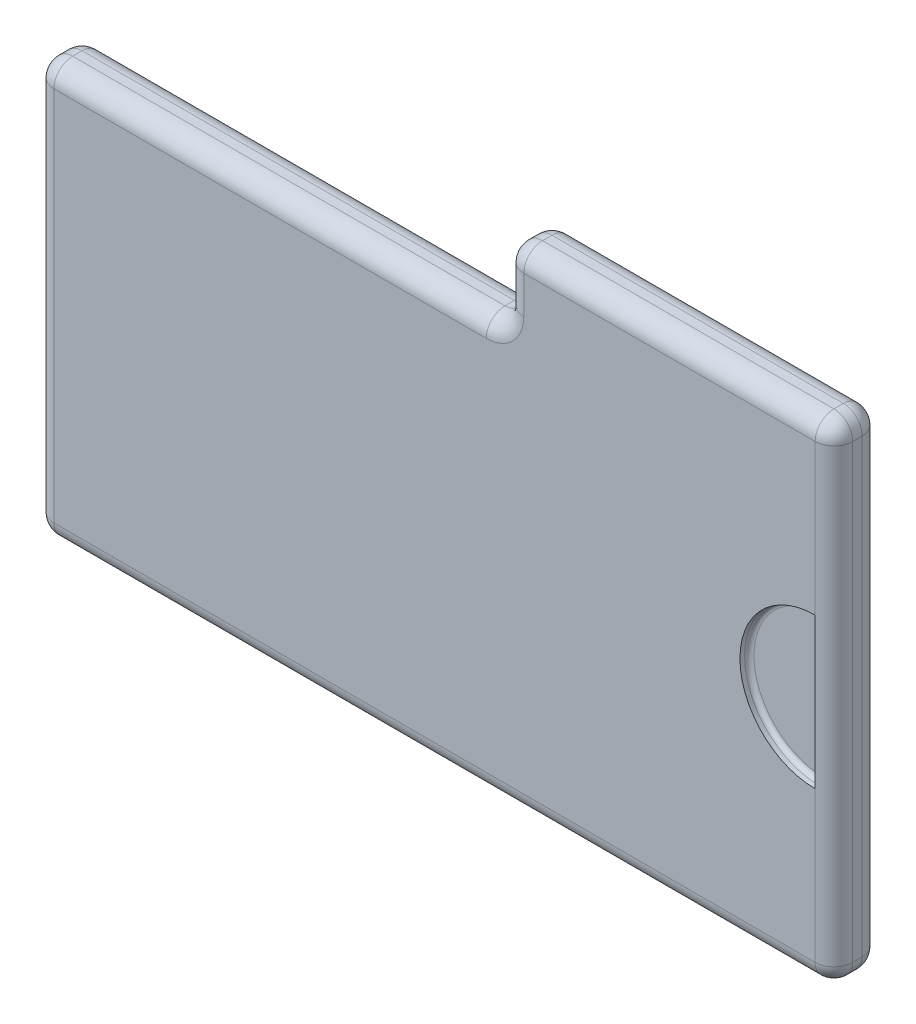
ISO-10303-21;
HEADER;
FILE_DESCRIPTION(('STEP AP214'),'2;1');
FILE_NAME('part.step','',(''),(''),'','','');
FILE_SCHEMA(('AUTOMOTIVE_DESIGN { 1 0 10303 214 1 1 1 1 }'));
ENDSEC;
DATA;
#1=APPLICATION_CONTEXT('core data for automotive mechanical design processes');
#2=APPLICATION_PROTOCOL_DEFINITION('international standard','automotive_design',2000,#1);
#3=PRODUCT_CONTEXT('',#1,'mechanical');
#4=PRODUCT('Part','Part','',(#3));
#5=PRODUCT_RELATED_PRODUCT_CATEGORY('part','',(#4));
#6=PRODUCT_DEFINITION_FORMATION('','',#4);
#7=PRODUCT_DEFINITION_CONTEXT('part definition',#1,'design');
#8=PRODUCT_DEFINITION('design','',#6,#7);
#9=PRODUCT_DEFINITION_SHAPE('','',#8);
#10=(LENGTH_UNIT() NAMED_UNIT(*) SI_UNIT(.MILLI.,.METRE.));
#11=(NAMED_UNIT(*) PLANE_ANGLE_UNIT() SI_UNIT($,.RADIAN.));
#12=(NAMED_UNIT(*) SI_UNIT($,.STERADIAN.) SOLID_ANGLE_UNIT());
#13=UNCERTAINTY_MEASURE_WITH_UNIT(LENGTH_MEASURE(1.E-05),#10,'distance_accuracy_value','');
#14=(GEOMETRIC_REPRESENTATION_CONTEXT(3) GLOBAL_UNCERTAINTY_ASSIGNED_CONTEXT((#13)) GLOBAL_UNIT_ASSIGNED_CONTEXT((#10,
#11,#12)) REPRESENTATION_CONTEXT('',''));
#15=CARTESIAN_POINT('',(0.,0.,0.));
#16=DIRECTION('',(0.,0.,1.));
#17=DIRECTION('',(1.,0.,0.));
#18=AXIS2_PLACEMENT_3D('',#15,#16,#17);
#19=CARTESIAN_POINT('',(42.5,26.,2.5));
#20=DIRECTION('',(-1.,0.,0.));
#21=DIRECTION('',(0.,0.,1.));
#22=AXIS2_PLACEMENT_3D('',#19,#20,#21);
#23=PLANE('',#22);
#24=DIRECTION('',(0.,1.,0.));
#25=VECTOR('',#24,1.);
#26=CARTESIAN_POINT('',(42.5,26.,-0.5));
#27=LINE('',#26,#25);
#28=CARTESIAN_POINT('',(42.5,-24.,-0.5));
#29=VERTEX_POINT('',#28);
#30=CARTESIAN_POINT('',(42.5,24.,-0.5));
#31=VERTEX_POINT('',#30);
#32=EDGE_CURVE('E292',#29,#31,#27,.T.);
#33=ORIENTED_EDGE('',*,*,#32,.T.);
#34=DIRECTION('',(0.,0.,-1.));
#35=VECTOR('',#34,1.);
#36=CARTESIAN_POINT('',(42.5,24.,2.5));
#37=LINE('',#36,#35);
#38=CARTESIAN_POINT('',(42.5,24.,0.5));
#39=VERTEX_POINT('',#38);
#40=EDGE_CURVE('E299',#31,#39,#37,.F.);
#41=ORIENTED_EDGE('',*,*,#40,.T.);
#42=DIRECTION('',(0.,1.,0.));
#43=VECTOR('',#42,1.);
#44=CARTESIAN_POINT('',(42.5,-26.,0.5));
#45=LINE('',#44,#43);
#46=CARTESIAN_POINT('',(42.5,-24.,0.5));
#47=VERTEX_POINT('',#46);
#48=EDGE_CURVE('E295',#39,#47,#45,.F.);
#49=ORIENTED_EDGE('',*,*,#48,.T.);
#50=DIRECTION('',(0.,0.,-1.));
#51=VECTOR('',#50,1.);
#52=CARTESIAN_POINT('',(42.5,-24.,2.5));
#53=LINE('',#52,#51);
#54=EDGE_CURVE('E289',#47,#29,#53,.T.);
#55=ORIENTED_EDGE('',*,*,#54,.T.);
#56=EDGE_LOOP('',(#33,#41,#49,#55));
#57=FACE_BOUND('',#56,.T.);
#58=ADVANCED_FACE('F47',(#57),#23,.F.);
#59=CARTESIAN_POINT('',(7.5,26.,2.5));
#60=DIRECTION('',(0.,-1.,0.));
#61=DIRECTION('',(0.,0.,-1.));
#62=AXIS2_PLACEMENT_3D('',#59,#60,#61);
#63=PLANE('',#62);
#64=DIRECTION('',(-1.,0.,0.));
#65=VECTOR('',#64,1.);
#66=CARTESIAN_POINT('',(42.5,26.,0.5));
#67=LINE('',#66,#65);
#68=CARTESIAN_POINT('',(9.49999999999999,26.,0.5));
#69=VERTEX_POINT('',#68);
#70=CARTESIAN_POINT('',(40.5,26.,0.5));
#71=VERTEX_POINT('',#70);
#72=EDGE_CURVE('E308',#69,#71,#67,.F.);
#73=ORIENTED_EDGE('',*,*,#72,.T.);
#74=DIRECTION('',(0.,0.,-1.));
#75=VECTOR('',#74,1.);
#76=CARTESIAN_POINT('',(40.5,26.,2.5));
#77=LINE('',#76,#75);
#78=CARTESIAN_POINT('',(40.5,26.,-0.5));
#79=VERTEX_POINT('',#78);
#80=EDGE_CURVE('E311',#71,#79,#77,.T.);
#81=ORIENTED_EDGE('',*,*,#80,.T.);
#82=DIRECTION('',(-1.,0.,0.));
#83=VECTOR('',#82,1.);
#84=CARTESIAN_POINT('',(7.5,26.,-0.5));
#85=LINE('',#84,#83);
#86=CARTESIAN_POINT('',(9.49999999999999,26.,-0.5));
#87=VERTEX_POINT('',#86);
#88=EDGE_CURVE('E302',#79,#87,#85,.T.);
#89=ORIENTED_EDGE('',*,*,#88,.T.);
#90=DIRECTION('',(0.,0.,-1.));
#91=VECTOR('',#90,1.);
#92=CARTESIAN_POINT('',(9.49999999999999,26.,2.5));
#93=LINE('',#92,#91);
#94=EDGE_CURVE('E305',#87,#69,#93,.F.);
#95=ORIENTED_EDGE('',*,*,#94,.T.);
#96=EDGE_LOOP('',(#73,#81,#89,#95));
#97=FACE_BOUND('',#96,.T.);
#98=ADVANCED_FACE('F631',(#97),#63,.F.);
#99=CARTESIAN_POINT('',(7.5,26.,2.5));
#100=DIRECTION('',(1.,0.,0.));
#101=DIRECTION('',(0.,1.,0.));
#102=AXIS2_PLACEMENT_3D('',#99,#100,#101);
#103=PLANE('',#102);
#104=DIRECTION('',(0.,-1.,0.));
#105=VECTOR('',#104,1.);
#106=CARTESIAN_POINT('',(7.5,26.,0.5));
#107=LINE('',#106,#105);
#108=CARTESIAN_POINT('',(7.5,20.,0.5));
#109=VERTEX_POINT('',#108);
#110=CARTESIAN_POINT('',(7.5,24.,0.5));
#111=VERTEX_POINT('',#110);
#112=EDGE_CURVE('E259',#109,#111,#107,.F.);
#113=ORIENTED_EDGE('',*,*,#112,.T.);
#114=DIRECTION('',(0.,0.,-1.));
#115=VECTOR('',#114,1.);
#116=CARTESIAN_POINT('',(7.5,24.,2.5));
#117=LINE('',#116,#115);
#118=CARTESIAN_POINT('',(7.5,24.,-0.5));
#119=VERTEX_POINT('',#118);
#120=EDGE_CURVE('E263',#111,#119,#117,.T.);
#121=ORIENTED_EDGE('',*,*,#120,.T.);
#122=DIRECTION('',(0.,-1.,0.));
#123=VECTOR('',#122,1.);
#124=CARTESIAN_POINT('',(7.5,26.,-0.5));
#125=LINE('',#124,#123);
#126=CARTESIAN_POINT('',(7.5,20.,-0.5));
#127=VERTEX_POINT('',#126);
#128=EDGE_CURVE('E256',#119,#127,#125,.T.);
#129=ORIENTED_EDGE('',*,*,#128,.T.);
#130=DIRECTION('',(0.,0.,-1.));
#131=VECTOR('',#130,1.);
#132=CARTESIAN_POINT('',(7.5,20.,2.5));
#133=LINE('',#132,#131);
#134=EDGE_CURVE('E253',#127,#109,#133,.F.);
#135=ORIENTED_EDGE('',*,*,#134,.T.);
#136=EDGE_LOOP('',(#113,#121,#129,#135));
#137=FACE_BOUND('',#136,.T.);
#138=ADVANCED_FACE('F635',(#137),#103,.F.);
#139=CARTESIAN_POINT('',(-7.5,18.,2.5));
#140=DIRECTION('',(0.,-1.,0.));
#141=DIRECTION('',(1.,0.,0.));
#142=AXIS2_PLACEMENT_3D('',#139,#140,#141);
#143=PLANE('',#142);
#144=DIRECTION('',(-1.,0.,0.));
#145=VECTOR('',#144,1.);
#146=CARTESIAN_POINT('',(7.5,18.,0.5));
#147=LINE('',#146,#145);
#148=CARTESIAN_POINT('',(-40.5,18.,0.5));
#149=VERTEX_POINT('',#148);
#150=CARTESIAN_POINT('',(5.5,18.,0.5));
#151=VERTEX_POINT('',#150);
#152=EDGE_CURVE('E321',#149,#151,#147,.F.);
#153=ORIENTED_EDGE('',*,*,#152,.T.);
#154=DIRECTION('',(0.,0.,-1.));
#155=VECTOR('',#154,1.);
#156=CARTESIAN_POINT('',(5.5,18.,-2.5));
#157=LINE('',#156,#155);
#158=CARTESIAN_POINT('',(5.5,18.,-0.5));
#159=VERTEX_POINT('',#158);
#160=EDGE_CURVE('E324',#151,#159,#157,.T.);
#161=ORIENTED_EDGE('',*,*,#160,.T.);
#162=DIRECTION('',(-1.,0.,0.));
#163=VECTOR('',#162,1.);
#164=CARTESIAN_POINT('',(-7.5,18.,-0.5));
#165=LINE('',#164,#163);
#166=CARTESIAN_POINT('',(-40.5,18.,-0.5));
#167=VERTEX_POINT('',#166);
#168=EDGE_CURVE('E318',#159,#167,#165,.T.);
#169=ORIENTED_EDGE('',*,*,#168,.T.);
#170=DIRECTION('',(0.,0.,-1.));
#171=VECTOR('',#170,1.);
#172=CARTESIAN_POINT('',(-40.5,18.,2.5));
#173=LINE('',#172,#171);
#174=EDGE_CURVE('E315',#167,#149,#173,.F.);
#175=ORIENTED_EDGE('',*,*,#174,.T.);
#176=EDGE_LOOP('',(#153,#161,#169,#175));
#177=FACE_BOUND('',#176,.T.);
#178=ADVANCED_FACE('F639',(#177),#143,.F.);
#179=CARTESIAN_POINT('',(-42.5,18.,2.5));
#180=DIRECTION('',(1.,0.,0.));
#181=DIRECTION('',(0.,0.,-1.));
#182=AXIS2_PLACEMENT_3D('',#179,#180,#181);
#183=PLANE('',#182);
#184=DIRECTION('',(0.,-1.,0.));
#185=VECTOR('',#184,1.);
#186=CARTESIAN_POINT('',(-42.5,18.,0.5));
#187=LINE('',#186,#185);
#188=CARTESIAN_POINT('',(-42.5,-24.,0.5));
#189=VERTEX_POINT('',#188);
#190=CARTESIAN_POINT('',(-42.5,16.,0.5));
#191=VERTEX_POINT('',#190);
#192=EDGE_CURVE('E334',#189,#191,#187,.F.);
#193=ORIENTED_EDGE('',*,*,#192,.T.);
#194=DIRECTION('',(0.,0.,-1.));
#195=VECTOR('',#194,1.);
#196=CARTESIAN_POINT('',(-42.5,16.,2.5));
#197=LINE('',#196,#195);
#198=CARTESIAN_POINT('',(-42.5,16.,-0.5));
#199=VERTEX_POINT('',#198);
#200=EDGE_CURVE('E337',#191,#199,#197,.T.);
#201=ORIENTED_EDGE('',*,*,#200,.T.);
#202=DIRECTION('',(0.,-1.,0.));
#203=VECTOR('',#202,1.);
#204=CARTESIAN_POINT('',(-42.5,18.,-0.5));
#205=LINE('',#204,#203);
#206=CARTESIAN_POINT('',(-42.5,-24.,-0.5));
#207=VERTEX_POINT('',#206);
#208=EDGE_CURVE('E331',#199,#207,#205,.T.);
#209=ORIENTED_EDGE('',*,*,#208,.T.);
#210=DIRECTION('',(0.,0.,-1.));
#211=VECTOR('',#210,1.);
#212=CARTESIAN_POINT('',(-42.5,-24.,2.5));
#213=LINE('',#212,#211);
#214=EDGE_CURVE('E328',#207,#189,#213,.F.);
#215=ORIENTED_EDGE('',*,*,#214,.T.);
#216=EDGE_LOOP('',(#193,#201,#209,#215));
#217=FACE_BOUND('',#216,.T.);
#218=ADVANCED_FACE('F643',(#217),#183,.F.);
#219=CARTESIAN_POINT('',(-42.5,-26.,2.5));
#220=DIRECTION('',(0.,1.,0.));
#221=DIRECTION('',(-1.,0.,0.));
#222=AXIS2_PLACEMENT_3D('',#219,#220,#221);
#223=PLANE('',#222);
#224=DIRECTION('',(1.,0.,0.));
#225=VECTOR('',#224,1.);
#226=CARTESIAN_POINT('',(-42.5,-26.,0.5));
#227=LINE('',#226,#225);
#228=CARTESIAN_POINT('',(40.5,-26.,0.5));
#229=VERTEX_POINT('',#228);
#230=CARTESIAN_POINT('',(-40.5,-26.,0.5));
#231=VERTEX_POINT('',#230);
#232=EDGE_CURVE('E347',#229,#231,#227,.F.);
#233=ORIENTED_EDGE('',*,*,#232,.T.);
#234=DIRECTION('',(0.,0.,-1.));
#235=VECTOR('',#234,1.);
#236=CARTESIAN_POINT('',(-40.5,-26.,2.5));
#237=LINE('',#236,#235);
#238=CARTESIAN_POINT('',(-40.5,-26.,-0.5));
#239=VERTEX_POINT('',#238);
#240=EDGE_CURVE('E350',#231,#239,#237,.T.);
#241=ORIENTED_EDGE('',*,*,#240,.T.);
#242=DIRECTION('',(1.,0.,0.));
#243=VECTOR('',#242,1.);
#244=CARTESIAN_POINT('',(-42.5,-26.,-0.5));
#245=LINE('',#244,#243);
#246=CARTESIAN_POINT('',(40.5,-26.,-0.5));
#247=VERTEX_POINT('',#246);
#248=EDGE_CURVE('E341',#239,#247,#245,.T.);
#249=ORIENTED_EDGE('',*,*,#248,.T.);
#250=DIRECTION('',(0.,0.,-1.));
#251=VECTOR('',#250,1.);
#252=CARTESIAN_POINT('',(40.5,-26.,2.5));
#253=LINE('',#252,#251);
#254=EDGE_CURVE('E344',#247,#229,#253,.F.);
#255=ORIENTED_EDGE('',*,*,#254,.T.);
#256=EDGE_LOOP('',(#233,#241,#249,#255));
#257=FACE_BOUND('',#256,.T.);
#258=ADVANCED_FACE('F647',(#257),#223,.F.);
#259=CARTESIAN_POINT('',(0.,0.,2.5));
#260=DIRECTION('',(0.,0.,1.));
#261=DIRECTION('',(1.,0.,0.));
#262=AXIS2_PLACEMENT_3D('',#259,#260,#261);
#263=PLANE('',#262);
#264=CARTESIAN_POINT('',(40.5,0.,2.5));
#265=DIRECTION('',(0.,0.,1.));
#266=DIRECTION('',(-1.,0.,0.));
#267=AXIS2_PLACEMENT_3D('',#264,#265,#266);
#268=CIRCLE('',#267,8.);
#269=CARTESIAN_POINT('',(40.5,8.,2.5));
#270=VERTEX_POINT('',#269);
#271=CARTESIAN_POINT('',(40.5,-8.,2.5));
#272=VERTEX_POINT('',#271);
#273=EDGE_CURVE('E205',#270,#272,#268,.T.);
#274=ORIENTED_EDGE('',*,*,#273,.F.);
#275=DIRECTION('',(0.,1.,0.));
#276=VECTOR('',#275,1.);
#277=CARTESIAN_POINT('',(40.5,26.,2.5));
#278=LINE('',#277,#276);
#279=CARTESIAN_POINT('',(40.5,24.,2.5));
#280=VERTEX_POINT('',#279);
#281=EDGE_CURVE('E223',#270,#280,#278,.T.);
#282=ORIENTED_EDGE('',*,*,#281,.T.);
#283=DIRECTION('',(-1.,0.,0.));
#284=VECTOR('',#283,1.);
#285=CARTESIAN_POINT('',(7.5,24.,2.5));
#286=LINE('',#285,#284);
#287=CARTESIAN_POINT('',(9.5,24.,2.5));
#288=VERTEX_POINT('',#287);
#289=EDGE_CURVE('E250',#280,#288,#286,.T.);
#290=ORIENTED_EDGE('',*,*,#289,.T.);
#291=DIRECTION('',(0.,-1.,0.));
#292=VECTOR('',#291,1.);
#293=CARTESIAN_POINT('',(9.5,18.,2.5));
#294=LINE('',#293,#292);
#295=CARTESIAN_POINT('',(9.5,20.,2.5));
#296=VERTEX_POINT('',#295);
#297=EDGE_CURVE('E246',#288,#296,#294,.T.);
#298=ORIENTED_EDGE('',*,*,#297,.T.);
#299=CARTESIAN_POINT('',(5.5,20.,2.5));
#300=DIRECTION('',(0.,0.,1.));
#301=DIRECTION('',(1.,0.,0.));
#302=AXIS2_PLACEMENT_3D('',#299,#300,#301);
#303=CIRCLE('',#302,4.);
#304=CARTESIAN_POINT('',(5.5,16.,2.5));
#305=VERTEX_POINT('',#304);
#306=EDGE_CURVE('E238',#305,#296,#303,.T.);
#307=ORIENTED_EDGE('',*,*,#306,.F.);
#308=DIRECTION('',(-1.,0.,0.));
#309=VECTOR('',#308,1.);
#310=CARTESIAN_POINT('',(-42.5,16.,2.5));
#311=LINE('',#310,#309);
#312=CARTESIAN_POINT('',(-40.5,16.,2.5));
#313=VERTEX_POINT('',#312);
#314=EDGE_CURVE('E234',#305,#313,#311,.T.);
#315=ORIENTED_EDGE('',*,*,#314,.T.);
#316=DIRECTION('',(0.,-1.,0.));
#317=VECTOR('',#316,1.);
#318=CARTESIAN_POINT('',(-40.5,-26.,2.5));
#319=LINE('',#318,#317);
#320=CARTESIAN_POINT('',(-40.5,-24.,2.5));
#321=VERTEX_POINT('',#320);
#322=EDGE_CURVE('E239',#313,#321,#319,.T.);
#323=ORIENTED_EDGE('',*,*,#322,.T.);
#324=DIRECTION('',(1.,0.,0.));
#325=VECTOR('',#324,1.);
#326=CARTESIAN_POINT('',(42.5,-24.,2.5));
#327=LINE('',#326,#325);
#328=CARTESIAN_POINT('',(40.5,-24.,2.5));
#329=VERTEX_POINT('',#328);
#330=EDGE_CURVE('E489',#321,#329,#327,.T.);
#331=ORIENTED_EDGE('',*,*,#330,.T.);
#332=EDGE_CURVE('E225',#329,#272,#278,.T.);
#333=ORIENTED_EDGE('',*,*,#332,.T.);
#334=EDGE_LOOP('',(#274,#282,#290,#298,#307,#315,#323,#331,#333));
#335=FACE_BOUND('',#334,.T.);
#336=ADVANCED_FACE('F222',(#335),#263,.T.);
#337=CARTESIAN_POINT('',(0.,0.,-2.5));
#338=DIRECTION('',(0.,0.,1.));
#339=DIRECTION('',(1.,0.,0.));
#340=AXIS2_PLACEMENT_3D('',#337,#338,#339);
#341=PLANE('',#340);
#342=CARTESIAN_POINT('',(5.5,20.,-2.5));
#343=DIRECTION('',(0.,0.,1.));
#344=DIRECTION('',(1.,0.,0.));
#345=AXIS2_PLACEMENT_3D('',#342,#343,#344);
#346=CIRCLE('',#345,4.);
#347=CARTESIAN_POINT('',(9.49999999999999,20.,-2.5));
#348=VERTEX_POINT('',#347);
#349=CARTESIAN_POINT('',(5.5,16.,-2.5));
#350=VERTEX_POINT('',#349);
#351=EDGE_CURVE('E278',#348,#350,#346,.F.);
#352=ORIENTED_EDGE('',*,*,#351,.F.);
#353=DIRECTION('',(0.,-1.,0.));
#354=VECTOR('',#353,1.);
#355=CARTESIAN_POINT('',(9.5,0.,-2.5));
#356=LINE('',#355,#354);
#357=CARTESIAN_POINT('',(9.49999999999999,24.,-2.5));
#358=VERTEX_POINT('',#357);
#359=EDGE_CURVE('E285',#348,#358,#356,.F.);
#360=ORIENTED_EDGE('',*,*,#359,.T.);
#361=DIRECTION('',(-1.,0.,0.));
#362=VECTOR('',#361,1.);
#363=CARTESIAN_POINT('',(0.,24.,-2.5));
#364=LINE('',#363,#362);
#365=CARTESIAN_POINT('',(40.5,24.,-2.5));
#366=VERTEX_POINT('',#365);
#367=EDGE_CURVE('E282',#358,#366,#364,.F.);
#368=ORIENTED_EDGE('',*,*,#367,.T.);
#369=DIRECTION('',(0.,1.,0.));
#370=VECTOR('',#369,1.);
#371=CARTESIAN_POINT('',(40.5,0.,-2.5));
#372=LINE('',#371,#370);
#373=CARTESIAN_POINT('',(40.5,-24.,-2.5));
#374=VERTEX_POINT('',#373);
#375=EDGE_CURVE('E275',#366,#374,#372,.F.);
#376=ORIENTED_EDGE('',*,*,#375,.T.);
#377=DIRECTION('',(1.,0.,0.));
#378=VECTOR('',#377,1.);
#379=CARTESIAN_POINT('',(0.,-24.,-2.5));
#380=LINE('',#379,#378);
#381=CARTESIAN_POINT('',(-40.5,-24.,-2.5));
#382=VERTEX_POINT('',#381);
#383=EDGE_CURVE('E266',#374,#382,#380,.F.);
#384=ORIENTED_EDGE('',*,*,#383,.T.);
#385=DIRECTION('',(0.,-1.,0.));
#386=VECTOR('',#385,1.);
#387=CARTESIAN_POINT('',(-40.5,0.,-2.5));
#388=LINE('',#387,#386);
#389=CARTESIAN_POINT('',(-40.5,16.,-2.5));
#390=VERTEX_POINT('',#389);
#391=EDGE_CURVE('E269',#382,#390,#388,.F.);
#392=ORIENTED_EDGE('',*,*,#391,.T.);
#393=DIRECTION('',(-1.,0.,0.));
#394=VECTOR('',#393,1.);
#395=CARTESIAN_POINT('',(0.,16.,-2.5));
#396=LINE('',#395,#394);
#397=EDGE_CURVE('E272',#390,#350,#396,.F.);
#398=ORIENTED_EDGE('',*,*,#397,.T.);
#399=EDGE_LOOP('',(#352,#360,#368,#376,#384,#392,#398));
#400=FACE_BOUND('',#399,.T.);
#401=ADVANCED_FACE('F514',(#400),#341,.F.);
#402=CARTESIAN_POINT('',(-42.5,-24.,-0.5));
#403=DIRECTION('',(1.,0.,0.));
#404=DIRECTION('',(0.,1.,0.));
#405=AXIS2_PLACEMENT_3D('',#402,#403,#404);
#406=CYLINDRICAL_SURFACE('',#405,2.);
#407=CARTESIAN_POINT('',(40.5,-24.,-0.5));
#408=DIRECTION('',(1.,0.,0.));
#409=DIRECTION('',(0.,0.,-1.));
#410=AXIS2_PLACEMENT_3D('',#407,#408,#409);
#411=CIRCLE('',#410,2.);
#412=EDGE_CURVE('E485',#247,#374,#411,.T.);
#413=ORIENTED_EDGE('',*,*,#412,.F.);
#414=ORIENTED_EDGE('',*,*,#248,.F.);
#415=CARTESIAN_POINT('',(-40.5,-24.,-0.5));
#416=DIRECTION('',(-1.,0.,0.));
#417=DIRECTION('',(0.,0.,1.));
#418=AXIS2_PLACEMENT_3D('',#415,#416,#417);
#419=CIRCLE('',#418,2.);
#420=EDGE_CURVE('E481',#382,#239,#419,.T.);
#421=ORIENTED_EDGE('',*,*,#420,.F.);
#422=ORIENTED_EDGE('',*,*,#383,.F.);
#423=EDGE_LOOP('',(#413,#414,#421,#422));
#424=FACE_BOUND('',#423,.T.);
#425=ADVANCED_FACE('F509',(#424),#406,.T.);
#426=CARTESIAN_POINT('',(40.5,-24.,-0.5));
#427=DIRECTION('',(0.,0.,-1.));
#428=DIRECTION('',(-1.,0.,0.));
#429=AXIS2_PLACEMENT_3D('',#426,#427,#428);
#430=SPHERICAL_SURFACE('',#429,2.);
#431=CARTESIAN_POINT('',(40.5,-24.,-0.5));
#432=DIRECTION('',(0.,0.,-1.));
#433=DIRECTION('',(-1.,0.,0.));
#434=AXIS2_PLACEMENT_3D('',#431,#432,#433);
#435=CIRCLE('',#434,2.);
#436=EDGE_CURVE('E473',#247,#29,#435,.F.);
#437=ORIENTED_EDGE('',*,*,#436,.F.);
#438=ORIENTED_EDGE('',*,*,#412,.T.);
#439=CARTESIAN_POINT('',(40.5,-24.,-0.5));
#440=DIRECTION('',(0.,-1.,0.));
#441=DIRECTION('',(1.,0.,0.));
#442=AXIS2_PLACEMENT_3D('',#439,#440,#441);
#443=CIRCLE('',#442,2.);
#444=EDGE_CURVE('E477',#29,#374,#443,.F.);
#445=ORIENTED_EDGE('',*,*,#444,.F.);
#446=EDGE_LOOP('',(#437,#438,#445));
#447=FACE_BOUND('',#446,.T.);
#448=ADVANCED_FACE('F513',(#447),#430,.T.);
#449=CARTESIAN_POINT('',(-40.5,-24.,-0.5));
#450=DIRECTION('',(0.,-1.,0.));
#451=DIRECTION('',(0.,0.,-1.));
#452=AXIS2_PLACEMENT_3D('',#449,#450,#451);
#453=SPHERICAL_SURFACE('',#452,2.);
#454=CARTESIAN_POINT('',(-40.5,-24.,-0.5));
#455=DIRECTION('',(0.,-1.,0.));
#456=DIRECTION('',(0.,0.,-1.));
#457=AXIS2_PLACEMENT_3D('',#454,#455,#456);
#458=CIRCLE('',#457,2.);
#459=EDGE_CURVE('E466',#382,#207,#458,.F.);
#460=ORIENTED_EDGE('',*,*,#459,.F.);
#461=ORIENTED_EDGE('',*,*,#420,.T.);
#462=CARTESIAN_POINT('',(-40.5,-24.,-0.5));
#463=DIRECTION('',(0.,0.,-1.));
#464=DIRECTION('',(-1.,0.,0.));
#465=AXIS2_PLACEMENT_3D('',#462,#463,#464);
#466=CIRCLE('',#465,2.);
#467=EDGE_CURVE('E470',#207,#239,#466,.F.);
#468=ORIENTED_EDGE('',*,*,#467,.F.);
#469=EDGE_LOOP('',(#460,#461,#468));
#470=FACE_BOUND('',#469,.T.);
#471=ADVANCED_FACE('F518',(#470),#453,.T.);
#472=CARTESIAN_POINT('',(40.5,26.,-0.5));
#473=DIRECTION('',(0.,1.,0.));
#474=DIRECTION('',(0.,0.,1.));
#475=AXIS2_PLACEMENT_3D('',#472,#473,#474);
#476=CYLINDRICAL_SURFACE('',#475,2.);
#477=ORIENTED_EDGE('',*,*,#444,.T.);
#478=ORIENTED_EDGE('',*,*,#375,.F.);
#479=CARTESIAN_POINT('',(40.5,24.,-0.5));
#480=DIRECTION('',(0.,1.,0.));
#481=DIRECTION('',(0.,0.,1.));
#482=AXIS2_PLACEMENT_3D('',#479,#480,#481);
#483=CIRCLE('',#482,2.);
#484=EDGE_CURVE('E462',#31,#366,#483,.T.);
#485=ORIENTED_EDGE('',*,*,#484,.F.);
#486=ORIENTED_EDGE('',*,*,#32,.F.);
#487=EDGE_LOOP('',(#477,#478,#485,#486));
#488=FACE_BOUND('',#487,.T.);
#489=ADVANCED_FACE('F522',(#488),#476,.T.);
#490=CARTESIAN_POINT('',(40.5,-24.,2.5));
#491=DIRECTION('',(0.,0.,-1.));
#492=DIRECTION('',(-1.,0.,0.));
#493=AXIS2_PLACEMENT_3D('',#490,#491,#492);
#494=CYLINDRICAL_SURFACE('',#493,2.);
#495=ORIENTED_EDGE('',*,*,#436,.T.);
#496=ORIENTED_EDGE('',*,*,#54,.F.);
#497=CARTESIAN_POINT('',(40.5,-24.,0.5));
#498=DIRECTION('',(0.,0.,1.));
#499=DIRECTION('',(1.,0.,0.));
#500=AXIS2_PLACEMENT_3D('',#497,#498,#499);
#501=CIRCLE('',#500,2.);
#502=EDGE_CURVE('E458',#229,#47,#501,.T.);
#503=ORIENTED_EDGE('',*,*,#502,.F.);
#504=ORIENTED_EDGE('',*,*,#254,.F.);
#505=EDGE_LOOP('',(#495,#496,#503,#504));
#506=FACE_BOUND('',#505,.T.);
#507=ADVANCED_FACE('F526',(#506),#494,.T.);
#508=CARTESIAN_POINT('',(0.,-24.,0.5));
#509=DIRECTION('',(-1.,0.,0.));
#510=DIRECTION('',(0.,-1.,0.));
#511=AXIS2_PLACEMENT_3D('',#508,#509,#510);
#512=CYLINDRICAL_SURFACE('',#511,2.);
#513=CARTESIAN_POINT('',(-40.5,-24.,0.5));
#514=DIRECTION('',(-1.,0.,0.));
#515=DIRECTION('',(0.,0.,1.));
#516=AXIS2_PLACEMENT_3D('',#513,#514,#515);
#517=CIRCLE('',#516,2.);
#518=EDGE_CURVE('E450',#231,#321,#517,.T.);
#519=ORIENTED_EDGE('',*,*,#518,.F.);
#520=ORIENTED_EDGE('',*,*,#232,.F.);
#521=CARTESIAN_POINT('',(40.5,-24.,0.5));
#522=DIRECTION('',(1.,0.,0.));
#523=DIRECTION('',(0.,0.,-1.));
#524=AXIS2_PLACEMENT_3D('',#521,#522,#523);
#525=CIRCLE('',#524,2.);
#526=EDGE_CURVE('E454',#329,#229,#525,.T.);
#527=ORIENTED_EDGE('',*,*,#526,.F.);
#528=ORIENTED_EDGE('',*,*,#330,.F.);
#529=EDGE_LOOP('',(#519,#520,#527,#528));
#530=FACE_BOUND('',#529,.T.);
#531=ADVANCED_FACE('F530',(#530),#512,.T.);
#532=CARTESIAN_POINT('',(-40.5,-24.,2.5));
#533=DIRECTION('',(0.,0.,-1.));
#534=DIRECTION('',(-1.,0.,0.));
#535=AXIS2_PLACEMENT_3D('',#532,#533,#534);
#536=CYLINDRICAL_SURFACE('',#535,2.);
#537=ORIENTED_EDGE('',*,*,#467,.T.);
#538=ORIENTED_EDGE('',*,*,#240,.F.);
#539=CARTESIAN_POINT('',(-40.5,-24.,0.5));
#540=DIRECTION('',(0.,0.,1.));
#541=DIRECTION('',(1.,0.,0.));
#542=AXIS2_PLACEMENT_3D('',#539,#540,#541);
#543=CIRCLE('',#542,2.);
#544=EDGE_CURVE('E446',#189,#231,#543,.T.);
#545=ORIENTED_EDGE('',*,*,#544,.F.);
#546=ORIENTED_EDGE('',*,*,#214,.F.);
#547=EDGE_LOOP('',(#537,#538,#545,#546));
#548=FACE_BOUND('',#547,.T.);
#549=ADVANCED_FACE('F534',(#548),#536,.T.);
#550=CARTESIAN_POINT('',(-40.5,18.,-0.5));
#551=DIRECTION('',(0.,-1.,0.));
#552=DIRECTION('',(0.,0.,-1.));
#553=AXIS2_PLACEMENT_3D('',#550,#551,#552);
#554=CYLINDRICAL_SURFACE('',#553,2.);
#555=ORIENTED_EDGE('',*,*,#459,.T.);
#556=ORIENTED_EDGE('',*,*,#208,.F.);
#557=CARTESIAN_POINT('',(-40.5,16.,-0.5));
#558=DIRECTION('',(0.,1.,0.));
#559=DIRECTION('',(0.,0.,1.));
#560=AXIS2_PLACEMENT_3D('',#557,#558,#559);
#561=CIRCLE('',#560,2.);
#562=EDGE_CURVE('E442',#390,#199,#561,.T.);
#563=ORIENTED_EDGE('',*,*,#562,.F.);
#564=ORIENTED_EDGE('',*,*,#391,.F.);
#565=EDGE_LOOP('',(#555,#556,#563,#564));
#566=FACE_BOUND('',#565,.T.);
#567=ADVANCED_FACE('F538',(#566),#554,.T.);
#568=CARTESIAN_POINT('',(40.5,24.,-0.5));
#569=DIRECTION('',(0.,0.,-1.));
#570=DIRECTION('',(-1.,0.,0.));
#571=AXIS2_PLACEMENT_3D('',#568,#569,#570);
#572=SPHERICAL_SURFACE('',#571,2.);
#573=CARTESIAN_POINT('',(40.5,24.,-0.5));
#574=DIRECTION('',(0.,0.,-1.));
#575=DIRECTION('',(-1.,0.,0.));
#576=AXIS2_PLACEMENT_3D('',#573,#574,#575);
#577=CIRCLE('',#576,2.);
#578=EDGE_CURVE('E434',#31,#79,#577,.F.);
#579=ORIENTED_EDGE('',*,*,#578,.F.);
#580=ORIENTED_EDGE('',*,*,#484,.T.);
#581=CARTESIAN_POINT('',(40.5,24.,-0.5));
#582=DIRECTION('',(1.,0.,0.));
#583=DIRECTION('',(0.,0.,-1.));
#584=AXIS2_PLACEMENT_3D('',#581,#582,#583);
#585=CIRCLE('',#584,2.);
#586=EDGE_CURVE('E438',#79,#366,#585,.F.);
#587=ORIENTED_EDGE('',*,*,#586,.F.);
#588=EDGE_LOOP('',(#579,#580,#587));
#589=FACE_BOUND('',#588,.T.);
#590=ADVANCED_FACE('F542',(#589),#572,.T.);
#591=CARTESIAN_POINT('',(40.5,-24.,0.5));
#592=DIRECTION('',(0.,-1.,0.));
#593=DIRECTION('',(0.,0.,-1.));
#594=AXIS2_PLACEMENT_3D('',#591,#592,#593);
#595=SPHERICAL_SURFACE('',#594,2.);
#596=ORIENTED_EDGE('',*,*,#526,.T.);
#597=ORIENTED_EDGE('',*,*,#502,.T.);
#598=CARTESIAN_POINT('',(40.5,-24.,0.5));
#599=DIRECTION('',(0.,-1.,0.));
#600=DIRECTION('',(0.,0.,-1.));
#601=AXIS2_PLACEMENT_3D('',#598,#599,#600);
#602=CIRCLE('',#601,2.);
#603=EDGE_CURVE('E431',#329,#47,#602,.F.);
#604=ORIENTED_EDGE('',*,*,#603,.F.);
#605=EDGE_LOOP('',(#596,#597,#604));
#606=FACE_BOUND('',#605,.T.);
#607=ADVANCED_FACE('F546',(#606),#595,.T.);
#608=CARTESIAN_POINT('',(-40.5,-24.,0.5));
#609=DIRECTION('',(0.,-1.,0.));
#610=DIRECTION('',(0.,0.,-1.));
#611=AXIS2_PLACEMENT_3D('',#608,#609,#610);
#612=SPHERICAL_SURFACE('',#611,2.);
#613=ORIENTED_EDGE('',*,*,#544,.T.);
#614=ORIENTED_EDGE('',*,*,#518,.T.);
#615=CARTESIAN_POINT('',(-40.5,-24.,0.5));
#616=DIRECTION('',(0.,-1.,0.));
#617=DIRECTION('',(0.,0.,-1.));
#618=AXIS2_PLACEMENT_3D('',#615,#616,#617);
#619=CIRCLE('',#618,2.);
#620=EDGE_CURVE('E427',#189,#321,#619,.F.);
#621=ORIENTED_EDGE('',*,*,#620,.F.);
#622=EDGE_LOOP('',(#613,#614,#621));
#623=FACE_BOUND('',#622,.T.);
#624=ADVANCED_FACE('F550',(#623),#612,.T.);
#625=CARTESIAN_POINT('',(-40.5,16.,-0.5));
#626=DIRECTION('',(-1.,0.,0.));
#627=DIRECTION('',(0.,0.,1.));
#628=AXIS2_PLACEMENT_3D('',#625,#626,#627);
#629=SPHERICAL_SURFACE('',#628,2.);
#630=CARTESIAN_POINT('',(-40.5,16.,-0.5));
#631=DIRECTION('',(-1.,0.,0.));
#632=DIRECTION('',(0.,0.,1.));
#633=AXIS2_PLACEMENT_3D('',#630,#631,#632);
#634=CIRCLE('',#633,2.);
#635=EDGE_CURVE('E420',#390,#167,#634,.F.);
#636=ORIENTED_EDGE('',*,*,#635,.F.);
#637=ORIENTED_EDGE('',*,*,#562,.T.);
#638=CARTESIAN_POINT('',(-40.5,16.,-0.5));
#639=DIRECTION('',(0.,0.,-1.));
#640=DIRECTION('',(-1.,0.,0.));
#641=AXIS2_PLACEMENT_3D('',#638,#639,#640);
#642=CIRCLE('',#641,2.);
#643=EDGE_CURVE('E424',#167,#199,#642,.F.);
#644=ORIENTED_EDGE('',*,*,#643,.F.);
#645=EDGE_LOOP('',(#636,#637,#644));
#646=FACE_BOUND('',#645,.T.);
#647=ADVANCED_FACE('F554',(#646),#629,.T.);
#648=CARTESIAN_POINT('',(7.5,24.,-0.5));
#649=DIRECTION('',(-1.,0.,0.));
#650=DIRECTION('',(0.,0.,1.));
#651=AXIS2_PLACEMENT_3D('',#648,#649,#650);
#652=CYLINDRICAL_SURFACE('',#651,2.);
#653=ORIENTED_EDGE('',*,*,#586,.T.);
#654=ORIENTED_EDGE('',*,*,#367,.F.);
#655=CARTESIAN_POINT('',(9.49999999999999,24.,-0.5));
#656=DIRECTION('',(-1.,0.,0.));
#657=DIRECTION('',(0.,0.,1.));
#658=AXIS2_PLACEMENT_3D('',#655,#656,#657);
#659=CIRCLE('',#658,2.);
#660=EDGE_CURVE('E413',#87,#358,#659,.T.);
#661=ORIENTED_EDGE('',*,*,#660,.F.);
#662=ORIENTED_EDGE('',*,*,#88,.F.);
#663=EDGE_LOOP('',(#653,#654,#661,#662));
#664=FACE_BOUND('',#663,.T.);
#665=ADVANCED_FACE('F558',(#664),#652,.T.);
#666=CARTESIAN_POINT('',(40.5,24.,2.5));
#667=DIRECTION('',(0.,0.,-1.));
#668=DIRECTION('',(-1.,0.,0.));
#669=AXIS2_PLACEMENT_3D('',#666,#667,#668);
#670=CYLINDRICAL_SURFACE('',#669,2.);
#671=ORIENTED_EDGE('',*,*,#578,.T.);
#672=ORIENTED_EDGE('',*,*,#80,.F.);
#673=CARTESIAN_POINT('',(40.5,24.,0.5));
#674=DIRECTION('',(0.,0.,1.));
#675=DIRECTION('',(1.,0.,0.));
#676=AXIS2_PLACEMENT_3D('',#673,#674,#675);
#677=CIRCLE('',#676,2.);
#678=EDGE_CURVE('E409',#39,#71,#677,.T.);
#679=ORIENTED_EDGE('',*,*,#678,.F.);
#680=ORIENTED_EDGE('',*,*,#40,.F.);
#681=EDGE_LOOP('',(#671,#672,#679,#680));
#682=FACE_BOUND('',#681,.T.);
#683=ADVANCED_FACE('F562',(#682),#670,.T.);
#684=CARTESIAN_POINT('',(40.5,0.,0.5));
#685=DIRECTION('',(0.,-1.,0.));
#686=DIRECTION('',(0.,0.,-1.));
#687=AXIS2_PLACEMENT_3D('',#684,#685,#686);
#688=CYLINDRICAL_SURFACE('',#687,2.);
#689=ORIENTED_EDGE('',*,*,#603,.T.);
#690=ORIENTED_EDGE('',*,*,#48,.F.);
#691=CARTESIAN_POINT('',(40.5,24.,0.5));
#692=DIRECTION('',(0.,1.,0.));
#693=DIRECTION('',(0.,0.,1.));
#694=AXIS2_PLACEMENT_3D('',#691,#692,#693);
#695=CIRCLE('',#694,2.);
#696=EDGE_CURVE('E231',#280,#39,#695,.T.);
#697=ORIENTED_EDGE('',*,*,#696,.F.);
#698=ORIENTED_EDGE('',*,*,#281,.F.);
#699=DIRECTION('',(0.,1.,0.));
#700=VECTOR('',#699,1.);
#701=CARTESIAN_POINT('',(40.5,8.,2.5));
#702=LINE('',#701,#700);
#703=EDGE_CURVE('E213',#272,#270,#702,.T.);
#704=ORIENTED_EDGE('',*,*,#703,.F.);
#705=ORIENTED_EDGE('',*,*,#332,.F.);
#706=EDGE_LOOP('',(#689,#690,#697,#698,#704,#705));
#707=FACE_BOUND('',#706,.T.);
#708=ADVANCED_FACE('F228',(#707),#688,.T.);
#709=CARTESIAN_POINT('',(-40.5,0.,0.5));
#710=DIRECTION('',(0.,1.,0.));
#711=DIRECTION('',(0.,0.,1.));
#712=AXIS2_PLACEMENT_3D('',#709,#710,#711);
#713=CYLINDRICAL_SURFACE('',#712,2.);
#714=ORIENTED_EDGE('',*,*,#620,.T.);
#715=ORIENTED_EDGE('',*,*,#322,.F.);
#716=CARTESIAN_POINT('',(-40.5,16.,0.5));
#717=DIRECTION('',(0.,1.,0.));
#718=DIRECTION('',(0.,0.,1.));
#719=AXIS2_PLACEMENT_3D('',#716,#717,#718);
#720=CIRCLE('',#719,2.);
#721=EDGE_CURVE('E403',#191,#313,#720,.T.);
#722=ORIENTED_EDGE('',*,*,#721,.F.);
#723=ORIENTED_EDGE('',*,*,#192,.F.);
#724=EDGE_LOOP('',(#714,#715,#722,#723));
#725=FACE_BOUND('',#724,.T.);
#726=ADVANCED_FACE('F569',(#725),#713,.T.);
#727=CARTESIAN_POINT('',(-40.5,16.,2.5));
#728=DIRECTION('',(0.,0.,-1.));
#729=DIRECTION('',(-1.,0.,0.));
#730=AXIS2_PLACEMENT_3D('',#727,#728,#729);
#731=CYLINDRICAL_SURFACE('',#730,2.);
#732=ORIENTED_EDGE('',*,*,#643,.T.);
#733=ORIENTED_EDGE('',*,*,#200,.F.);
#734=CARTESIAN_POINT('',(-40.5,16.,0.5));
#735=DIRECTION('',(0.,0.,1.));
#736=DIRECTION('',(1.,0.,0.));
#737=AXIS2_PLACEMENT_3D('',#734,#735,#736);
#738=CIRCLE('',#737,2.);
#739=EDGE_CURVE('E399',#149,#191,#738,.T.);
#740=ORIENTED_EDGE('',*,*,#739,.F.);
#741=ORIENTED_EDGE('',*,*,#174,.F.);
#742=EDGE_LOOP('',(#732,#733,#740,#741));
#743=FACE_BOUND('',#742,.T.);
#744=ADVANCED_FACE('F572',(#743),#731,.T.);
#745=CARTESIAN_POINT('',(-7.5,16.,-0.5));
#746=DIRECTION('',(-1.,0.,0.));
#747=DIRECTION('',(0.,-1.,0.));
#748=AXIS2_PLACEMENT_3D('',#745,#746,#747);
#749=CYLINDRICAL_SURFACE('',#748,2.);
#750=ORIENTED_EDGE('',*,*,#635,.T.);
#751=ORIENTED_EDGE('',*,*,#168,.F.);
#752=CARTESIAN_POINT('',(5.5,16.,-0.5));
#753=DIRECTION('',(1.,0.,0.));
#754=DIRECTION('',(0.,0.,-1.));
#755=AXIS2_PLACEMENT_3D('',#752,#753,#754);
#756=CIRCLE('',#755,2.);
#757=EDGE_CURVE('E395',#350,#159,#756,.T.);
#758=ORIENTED_EDGE('',*,*,#757,.F.);
#759=ORIENTED_EDGE('',*,*,#397,.F.);
#760=EDGE_LOOP('',(#750,#751,#758,#759));
#761=FACE_BOUND('',#760,.T.);
#762=ADVANCED_FACE('F576',(#761),#749,.T.);
#763=CARTESIAN_POINT('',(9.49999999999999,26.,-0.5));
#764=DIRECTION('',(0.,-1.,0.));
#765=DIRECTION('',(1.,0.,0.));
#766=AXIS2_PLACEMENT_3D('',#763,#764,#765);
#767=CYLINDRICAL_SURFACE('',#766,2.);
#768=CARTESIAN_POINT('',(9.49999999999999,24.,-0.5));
#769=DIRECTION('',(0.,1.,0.));
#770=DIRECTION('',(0.,0.,1.));
#771=AXIS2_PLACEMENT_3D('',#768,#769,#770);
#772=CIRCLE('',#771,2.);
#773=EDGE_CURVE('E416',#358,#119,#772,.T.);
#774=ORIENTED_EDGE('',*,*,#773,.F.);
#775=ORIENTED_EDGE('',*,*,#359,.F.);
#776=CARTESIAN_POINT('',(9.5,20.,-0.5));
#777=DIRECTION('',(0.,-1.,0.));
#778=DIRECTION('',(0.,0.,-1.));
#779=AXIS2_PLACEMENT_3D('',#776,#777,#778);
#780=CIRCLE('',#779,2.);
#781=EDGE_CURVE('E391',#127,#348,#780,.T.);
#782=ORIENTED_EDGE('',*,*,#781,.F.);
#783=ORIENTED_EDGE('',*,*,#128,.F.);
#784=EDGE_LOOP('',(#774,#775,#782,#783));
#785=FACE_BOUND('',#784,.T.);
#786=ADVANCED_FACE('F580',(#785),#767,.T.);
#787=CARTESIAN_POINT('',(9.49999999999999,24.,-0.5));
#788=DIRECTION('',(0.,0.,-1.));
#789=DIRECTION('',(-1.,0.,0.));
#790=AXIS2_PLACEMENT_3D('',#787,#788,#789);
#791=SPHERICAL_SURFACE('',#790,2.);
#792=ORIENTED_EDGE('',*,*,#660,.T.);
#793=ORIENTED_EDGE('',*,*,#773,.T.);
#794=CARTESIAN_POINT('',(9.49999999999999,24.,-0.5));
#795=DIRECTION('',(0.,0.,-1.));
#796=DIRECTION('',(-1.,0.,0.));
#797=AXIS2_PLACEMENT_3D('',#794,#795,#796);
#798=CIRCLE('',#797,2.);
#799=EDGE_CURVE('E387',#87,#119,#798,.F.);
#800=ORIENTED_EDGE('',*,*,#799,.F.);
#801=EDGE_LOOP('',(#792,#793,#800));
#802=FACE_BOUND('',#801,.T.);
#803=ADVANCED_FACE('F584',(#802),#791,.T.);
#804=CARTESIAN_POINT('',(40.5,24.,0.5));
#805=DIRECTION('',(1.,0.,0.));
#806=DIRECTION('',(0.,0.,-1.));
#807=AXIS2_PLACEMENT_3D('',#804,#805,#806);
#808=SPHERICAL_SURFACE('',#807,2.);
#809=ORIENTED_EDGE('',*,*,#696,.T.);
#810=ORIENTED_EDGE('',*,*,#678,.T.);
#811=CARTESIAN_POINT('',(40.5,24.,0.5));
#812=DIRECTION('',(1.,0.,0.));
#813=DIRECTION('',(0.,0.,-1.));
#814=AXIS2_PLACEMENT_3D('',#811,#812,#813);
#815=CIRCLE('',#814,2.);
#816=EDGE_CURVE('E383',#280,#71,#815,.F.);
#817=ORIENTED_EDGE('',*,*,#816,.F.);
#818=EDGE_LOOP('',(#809,#810,#817));
#819=FACE_BOUND('',#818,.T.);
#820=ADVANCED_FACE('F588',(#819),#808,.T.);
#821=CARTESIAN_POINT('',(-40.5,16.,0.5));
#822=DIRECTION('',(-1.,0.,0.));
#823=DIRECTION('',(0.,0.,1.));
#824=AXIS2_PLACEMENT_3D('',#821,#822,#823);
#825=SPHERICAL_SURFACE('',#824,2.);
#826=ORIENTED_EDGE('',*,*,#739,.T.);
#827=ORIENTED_EDGE('',*,*,#721,.T.);
#828=CARTESIAN_POINT('',(-40.5,16.,0.5));
#829=DIRECTION('',(-1.,0.,0.));
#830=DIRECTION('',(0.,0.,1.));
#831=AXIS2_PLACEMENT_3D('',#828,#829,#830);
#832=CIRCLE('',#831,2.);
#833=EDGE_CURVE('E379',#149,#313,#832,.F.);
#834=ORIENTED_EDGE('',*,*,#833,.F.);
#835=EDGE_LOOP('',(#826,#827,#834));
#836=FACE_BOUND('',#835,.T.);
#837=ADVANCED_FACE('F592',(#836),#825,.T.);
#838=CARTESIAN_POINT('',(5.5,20.,-0.5));
#839=DIRECTION('',(0.,0.,1.));
#840=DIRECTION('',(1.,0.,0.));
#841=AXIS2_PLACEMENT_3D('',#838,#839,#840);
#842=TOROIDAL_SURFACE('',#841,4.,2.);
#843=ORIENTED_EDGE('',*,*,#351,.T.);
#844=ORIENTED_EDGE('',*,*,#757,.T.);
#845=CARTESIAN_POINT('',(5.5,20.,-0.5));
#846=DIRECTION('',(0.,0.,1.));
#847=DIRECTION('',(1.,0.,0.));
#848=AXIS2_PLACEMENT_3D('',#845,#846,#847);
#849=CIRCLE('',#848,2.);
#850=EDGE_CURVE('E376',#127,#159,#849,.F.);
#851=ORIENTED_EDGE('',*,*,#850,.F.);
#852=ORIENTED_EDGE('',*,*,#781,.T.);
#853=EDGE_LOOP('',(#843,#844,#851,#852));
#854=FACE_BOUND('',#853,.T.);
#855=ADVANCED_FACE('F596',(#854),#842,.T.);
#856=CARTESIAN_POINT('',(9.49999999999999,24.,2.5));
#857=DIRECTION('',(0.,0.,-1.));
#858=DIRECTION('',(-1.,0.,0.));
#859=AXIS2_PLACEMENT_3D('',#856,#857,#858);
#860=CYLINDRICAL_SURFACE('',#859,2.);
#861=ORIENTED_EDGE('',*,*,#799,.T.);
#862=ORIENTED_EDGE('',*,*,#120,.F.);
#863=CARTESIAN_POINT('',(9.49999999999999,24.,0.5));
#864=DIRECTION('',(0.,0.,1.));
#865=DIRECTION('',(1.,0.,0.));
#866=AXIS2_PLACEMENT_3D('',#863,#864,#865);
#867=CIRCLE('',#866,2.);
#868=EDGE_CURVE('E372',#69,#111,#867,.T.);
#869=ORIENTED_EDGE('',*,*,#868,.F.);
#870=ORIENTED_EDGE('',*,*,#94,.F.);
#871=EDGE_LOOP('',(#861,#862,#869,#870));
#872=FACE_BOUND('',#871,.T.);
#873=ADVANCED_FACE('F600',(#872),#860,.T.);
#874=CARTESIAN_POINT('',(0.,24.,0.5));
#875=DIRECTION('',(1.,0.,0.));
#876=DIRECTION('',(0.,0.,-1.));
#877=AXIS2_PLACEMENT_3D('',#874,#875,#876);
#878=CYLINDRICAL_SURFACE('',#877,2.);
#879=ORIENTED_EDGE('',*,*,#816,.T.);
#880=ORIENTED_EDGE('',*,*,#72,.F.);
#881=CARTESIAN_POINT('',(9.5,24.,0.5));
#882=DIRECTION('',(-1.,0.,0.));
#883=DIRECTION('',(0.,-1.,0.));
#884=AXIS2_PLACEMENT_3D('',#881,#882,#883);
#885=CIRCLE('',#884,2.);
#886=EDGE_CURVE('E368',#288,#69,#885,.T.);
#887=ORIENTED_EDGE('',*,*,#886,.F.);
#888=ORIENTED_EDGE('',*,*,#289,.F.);
#889=EDGE_LOOP('',(#879,#880,#887,#888));
#890=FACE_BOUND('',#889,.T.);
#891=ADVANCED_FACE('F604',(#890),#878,.T.);
#892=CARTESIAN_POINT('',(0.,16.,0.5));
#893=DIRECTION('',(1.,0.,0.));
#894=DIRECTION('',(0.,1.,0.));
#895=AXIS2_PLACEMENT_3D('',#892,#893,#894);
#896=CYLINDRICAL_SURFACE('',#895,2.);
#897=ORIENTED_EDGE('',*,*,#833,.T.);
#898=ORIENTED_EDGE('',*,*,#314,.F.);
#899=CARTESIAN_POINT('',(5.5,16.,0.5));
#900=DIRECTION('',(1.,0.,0.));
#901=DIRECTION('',(0.,0.,-1.));
#902=AXIS2_PLACEMENT_3D('',#899,#900,#901);
#903=CIRCLE('',#902,2.);
#904=EDGE_CURVE('E364',#151,#305,#903,.T.);
#905=ORIENTED_EDGE('',*,*,#904,.F.);
#906=ORIENTED_EDGE('',*,*,#152,.F.);
#907=EDGE_LOOP('',(#897,#898,#905,#906));
#908=FACE_BOUND('',#907,.T.);
#909=ADVANCED_FACE('F608',(#908),#896,.T.);
#910=CARTESIAN_POINT('',(5.5,20.,2.5));
#911=DIRECTION('',(0.,0.,1.));
#912=DIRECTION('',(1.,0.,0.));
#913=AXIS2_PLACEMENT_3D('',#910,#911,#912);
#914=CYLINDRICAL_SURFACE('',#913,2.);
#915=ORIENTED_EDGE('',*,*,#850,.T.);
#916=ORIENTED_EDGE('',*,*,#160,.F.);
#917=CARTESIAN_POINT('',(5.5,20.,0.5));
#918=DIRECTION('',(0.,0.,1.));
#919=DIRECTION('',(1.,0.,0.));
#920=AXIS2_PLACEMENT_3D('',#917,#918,#919);
#921=CIRCLE('',#920,2.);
#922=EDGE_CURVE('E360',#109,#151,#921,.F.);
#923=ORIENTED_EDGE('',*,*,#922,.F.);
#924=ORIENTED_EDGE('',*,*,#134,.F.);
#925=EDGE_LOOP('',(#915,#916,#923,#924));
#926=FACE_BOUND('',#925,.T.);
#927=ADVANCED_FACE('F612',(#926),#914,.F.);
#928=CARTESIAN_POINT('',(9.49999999999999,24.,0.5));
#929=DIRECTION('',(0.,1.,0.));
#930=DIRECTION('',(0.,0.,1.));
#931=AXIS2_PLACEMENT_3D('',#928,#929,#930);
#932=SPHERICAL_SURFACE('',#931,2.);
#933=ORIENTED_EDGE('',*,*,#886,.T.);
#934=ORIENTED_EDGE('',*,*,#868,.T.);
#935=CARTESIAN_POINT('',(9.49999999999999,24.,0.5));
#936=DIRECTION('',(0.,1.,0.));
#937=DIRECTION('',(0.,0.,1.));
#938=AXIS2_PLACEMENT_3D('',#935,#936,#937);
#939=CIRCLE('',#938,2.);
#940=EDGE_CURVE('E357',#288,#111,#939,.F.);
#941=ORIENTED_EDGE('',*,*,#940,.F.);
#942=EDGE_LOOP('',(#933,#934,#941));
#943=FACE_BOUND('',#942,.T.);
#944=ADVANCED_FACE('F616',(#943),#932,.T.);
#945=CARTESIAN_POINT('',(5.5,20.,0.5));
#946=DIRECTION('',(0.,0.,1.));
#947=DIRECTION('',(1.,0.,0.));
#948=AXIS2_PLACEMENT_3D('',#945,#946,#947);
#949=TOROIDAL_SURFACE('',#948,4.,2.);
#950=ORIENTED_EDGE('',*,*,#904,.T.);
#951=ORIENTED_EDGE('',*,*,#306,.T.);
#952=CARTESIAN_POINT('',(9.5,20.,0.5));
#953=DIRECTION('',(0.,-1.,0.));
#954=DIRECTION('',(0.,0.,-1.));
#955=AXIS2_PLACEMENT_3D('',#952,#953,#954);
#956=CIRCLE('',#955,2.);
#957=EDGE_CURVE('E210',#109,#296,#956,.F.);
#958=ORIENTED_EDGE('',*,*,#957,.F.);
#959=ORIENTED_EDGE('',*,*,#922,.T.);
#960=EDGE_LOOP('',(#950,#951,#958,#959));
#961=FACE_BOUND('',#960,.T.);
#962=ADVANCED_FACE('F620',(#961),#949,.T.);
#963=CARTESIAN_POINT('',(9.5,0.,0.5));
#964=DIRECTION('',(0.,1.,0.));
#965=DIRECTION('',(-1.,0.,0.));
#966=AXIS2_PLACEMENT_3D('',#963,#964,#965);
#967=CYLINDRICAL_SURFACE('',#966,2.);
#968=ORIENTED_EDGE('',*,*,#940,.T.);
#969=ORIENTED_EDGE('',*,*,#112,.F.);
#970=ORIENTED_EDGE('',*,*,#957,.T.);
#971=ORIENTED_EDGE('',*,*,#297,.F.);
#972=EDGE_LOOP('',(#968,#969,#970,#971));
#973=FACE_BOUND('',#972,.T.);
#974=ADVANCED_FACE('F624',(#973),#967,.T.);
#975=CARTESIAN_POINT('',(40.5,0.,1.5));
#976=DIRECTION('',(0.,0.,1.));
#977=DIRECTION('',(1.,0.,0.));
#978=AXIS2_PLACEMENT_3D('',#975,#976,#977);
#979=CYLINDRICAL_SURFACE('',#978,8.);
#980=DIRECTION('',(0.,0.,1.));
#981=VECTOR('',#980,1.);
#982=CARTESIAN_POINT('',(40.5,-8.,1.5));
#983=LINE('',#982,#981);
#984=CARTESIAN_POINT('',(40.5,-8.,2.));
#985=VERTEX_POINT('',#984);
#986=EDGE_CURVE('E211',#985,#272,#983,.T.);
#987=ORIENTED_EDGE('',*,*,#986,.F.);
#988=CARTESIAN_POINT('',(40.5,0.,2.));
#989=DIRECTION('',(0.,0.,-1.));
#990=DIRECTION('',(-1.,0.,0.));
#991=AXIS2_PLACEMENT_3D('',#988,#989,#990);
#992=CIRCLE('',#991,8.);
#993=CARTESIAN_POINT('',(40.5,8.,2.));
#994=VERTEX_POINT('',#993);
#995=EDGE_CURVE('E11',#985,#994,#992,.T.);
#996=ORIENTED_EDGE('',*,*,#995,.T.);
#997=DIRECTION('',(0.,0.,1.));
#998=VECTOR('',#997,1.);
#999=CARTESIAN_POINT('',(40.5,8.,1.5));
#1000=LINE('',#999,#998);
#1001=EDGE_CURVE('E201',#994,#270,#1000,.T.);
#1002=ORIENTED_EDGE('',*,*,#1001,.T.);
#1003=ORIENTED_EDGE('',*,*,#273,.T.);
#1004=EDGE_LOOP('',(#987,#996,#1002,#1003));
#1005=FACE_BOUND('',#1004,.T.);
#1006=ADVANCED_FACE('F203',(#1005),#979,.F.);
#1007=CARTESIAN_POINT('',(40.5,8.,1.5));
#1008=DIRECTION('',(1.,0.,0.));
#1009=DIRECTION('',(0.,0.,-1.));
#1010=AXIS2_PLACEMENT_3D('',#1007,#1008,#1009);
#1011=PLANE('',#1010);
#1012=ORIENTED_EDGE('',*,*,#1001,.F.);
#1013=DIRECTION('',(0.,1.,0.));
#1014=VECTOR('',#1013,1.);
#1015=CARTESIAN_POINT('',(40.5,-8.,2.));
#1016=LINE('',#1015,#1014);
#1017=EDGE_CURVE('E62',#994,#985,#1016,.F.);
#1018=ORIENTED_EDGE('',*,*,#1017,.T.);
#1019=ORIENTED_EDGE('',*,*,#986,.T.);
#1020=ORIENTED_EDGE('',*,*,#703,.T.);
#1021=EDGE_LOOP('',(#1012,#1018,#1019,#1020));
#1022=FACE_BOUND('',#1021,.T.);
#1023=ADVANCED_FACE('F214',(#1022),#1011,.F.);
#1024=CARTESIAN_POINT('',(40.5,0.,1.5));
#1025=DIRECTION('',(0.,0.,-1.));
#1026=DIRECTION('',(-1.,0.,0.));
#1027=AXIS2_PLACEMENT_3D('',#1024,#1025,#1026);
#1028=PLANE('',#1027);
#1029=CARTESIAN_POINT('',(40.5,0.,1.5));
#1030=DIRECTION('',(0.,0.,-1.));
#1031=DIRECTION('',(-1.,0.,0.));
#1032=AXIS2_PLACEMENT_3D('',#1029,#1030,#1031);
#1033=CIRCLE('',#1032,7.5);
#1034=CARTESIAN_POINT('',(40.,7.48331477354788,1.5));
#1035=VERTEX_POINT('',#1034);
#1036=CARTESIAN_POINT('',(40.,-7.48331477354788,1.5));
#1037=VERTEX_POINT('',#1036);
#1038=EDGE_CURVE('E354',#1035,#1037,#1033,.F.);
#1039=ORIENTED_EDGE('',*,*,#1038,.T.);
#1040=DIRECTION('',(0.,1.,0.));
#1041=VECTOR('',#1040,1.);
#1042=CARTESIAN_POINT('',(40.,8.,1.5));
#1043=LINE('',#1042,#1041);
#1044=EDGE_CURVE('E492',#1037,#1035,#1043,.T.);
#1045=ORIENTED_EDGE('',*,*,#1044,.T.);
#1046=EDGE_LOOP('',(#1039,#1045));
#1047=FACE_BOUND('',#1046,.T.);
#1048=ADVANCED_FACE('F507',(#1047),#1028,.F.);
#1049=CARTESIAN_POINT('',(40.5,0.,2.));
#1050=DIRECTION('',(0.,0.,-1.));
#1051=DIRECTION('',(-1.,0.,0.));
#1052=AXIS2_PLACEMENT_3D('',#1049,#1050,#1051);
#1053=TOROIDAL_SURFACE('',#1052,7.5,0.5);
#1054=CARTESIAN_POINT('',(40.5,8.,2.));
#1055=CARTESIAN_POINT('',(40.5000378540204,8.0000364053109,1.97761501507848));
#1056=CARTESIAN_POINT('',(40.4984993785673,7.99849941816678,1.95528509312953));
#1057=CARTESIAN_POINT('',(40.4925978426265,7.99259532166611,1.91157395634698));
#1058=CARTESIAN_POINT('',(40.4882589412436,7.98825241844815,1.89018628306291));
#1059=CARTESIAN_POINT('',(40.4770895320534,7.97705845097955,1.84884952659806));
#1060=CARTESIAN_POINT('',(40.4702656104196,7.97021401648999,1.82889680615469));
#1061=CARTESIAN_POINT('',(40.4545480982513,7.95442220209403,1.79068289027116));
#1062=CARTESIAN_POINT('',(40.4456499815108,7.94547022277551,1.77242551795868));
#1063=CARTESIAN_POINT('',(40.4223065962862,7.92193740738206,1.73087058673541));
#1064=CARTESIAN_POINT('',(40.4070670285931,7.90653818698396,1.70848337444286));
#1065=CARTESIAN_POINT('',(40.3743234990623,7.87333814003056,1.66747427724568));
#1066=CARTESIAN_POINT('',(40.3568153185162,7.85553283641248,1.64885957733636));
#1067=CARTESIAN_POINT('',(40.3129591600663,7.81076336062194,1.60850952630238));
#1068=CARTESIAN_POINT('',(40.2858715389423,7.78297953625808,1.58849277957977));
#1069=CARTESIAN_POINT('',(40.2300124194828,7.72535005468624,1.55484874330646));
#1070=CARTESIAN_POINT('',(40.2012386592007,7.69550161766623,1.54123026840685));
#1071=CARTESIAN_POINT('',(40.1442758512593,7.63604971850211,1.52035510147307));
#1072=CARTESIAN_POINT('',(40.1161251881423,7.60650345607343,1.5128240591334));
#1073=CARTESIAN_POINT('',(40.0596315917642,7.54685316759846,1.50274231708522));
#1074=CARTESIAN_POINT('',(40.0312891417818,7.51675034445652,1.50018191290029));
#1075=CARTESIAN_POINT('',(40.0020390571094,7.48549438058181,1.50000312321437));
#1076=CARTESIAN_POINT('',(40.0010194498582,7.48440461272857,1.5000000057897));
#1077=CARTESIAN_POINT('',(40.,7.48331477354788,1.5));
#1078=B_SPLINE_CURVE_WITH_KNOTS('',3,(#1054,#1055,#1056,#1057,#1058,#1059,#1060,#1061,#1062,
#1063,#1064,#1065,#1066,#1067,#1068,#1069,#1070,#1071,#1072,#1073,#1074,#1075,#1076,#1077),
.UNSPECIFIED.,.F.,.F.,(4,2,2,2,2,2,2,2,2,2,2,4),(0.,0.0669622468030056,0.133354398964634,
0.199571854300215,0.265935181605364,0.35888016674726,0.452000541655261,0.582278052271247,
0.712734518657807,0.836919737376916,0.960862257009201,0.965339385657952),.UNSPECIFIED.);
#1079=EDGE_CURVE('E497',#994,#1035,#1078,.T.);
#1080=ORIENTED_EDGE('',*,*,#1079,.F.);
#1081=ORIENTED_EDGE('',*,*,#995,.F.);
#1082=CARTESIAN_POINT('',(40.5,-8.,2.));
#1083=CARTESIAN_POINT('',(40.5000378540204,-8.0000364053109,1.97761501507848));
#1084=CARTESIAN_POINT('',(40.4984993785673,-7.99849941816678,1.95528509312953));
#1085=CARTESIAN_POINT('',(40.4925978426265,-7.99259532166611,1.91157395634698));
#1086=CARTESIAN_POINT('',(40.4882589412436,-7.98825241844815,1.89018628306291));
#1087=CARTESIAN_POINT('',(40.4770895320534,-7.97705845097955,1.84884952659806));
#1088=CARTESIAN_POINT('',(40.4702656104196,-7.97021401648999,1.82889680615469));
#1089=CARTESIAN_POINT('',(40.4545480982513,-7.95442220209403,1.79068289027116));
#1090=CARTESIAN_POINT('',(40.4456499815108,-7.94547022277551,1.77242551795868));
#1091=CARTESIAN_POINT('',(40.4223065962862,-7.92193740738206,1.73087058673541));
#1092=CARTESIAN_POINT('',(40.4070670285931,-7.90653818698396,1.70848337444286));
#1093=CARTESIAN_POINT('',(40.3743234990623,-7.87333814003056,1.66747427724568));
#1094=CARTESIAN_POINT('',(40.3568153185162,-7.85553283641248,1.64885957733636));
#1095=CARTESIAN_POINT('',(40.3129591600663,-7.81076336062194,1.60850952630238));
#1096=CARTESIAN_POINT('',(40.2858715389423,-7.78297953625808,1.58849277957977));
#1097=CARTESIAN_POINT('',(40.2300124194828,-7.72535005468624,1.55484874330646));
#1098=CARTESIAN_POINT('',(40.2012386592007,-7.69550161766623,1.54123026840685));
#1099=CARTESIAN_POINT('',(40.1442758512593,-7.63604971850211,1.52035510147307));
#1100=CARTESIAN_POINT('',(40.1161251881423,-7.60650345607343,1.5128240591334));
#1101=CARTESIAN_POINT('',(40.0596315917642,-7.54685316759846,1.50274231708522));
#1102=CARTESIAN_POINT('',(40.0312891417818,-7.51675034445652,1.50018191290029));
#1103=CARTESIAN_POINT('',(40.0020390571094,-7.48549438058181,1.50000312321437));
#1104=CARTESIAN_POINT('',(40.0010194498582,-7.48440461272857,1.5000000057897));
#1105=CARTESIAN_POINT('',(40.,-7.48331477354788,1.5));
#1106=B_SPLINE_CURVE_WITH_KNOTS('',3,(#1082,#1083,#1084,#1085,#1086,#1087,#1088,#1089,#1090,
#1091,#1092,#1093,#1094,#1095,#1096,#1097,#1098,#1099,#1100,#1101,#1102,#1103,#1104,#1105),
.UNSPECIFIED.,.F.,.F.,(4,2,2,2,2,2,2,2,2,2,2,4),(0.,0.0669622468030056,0.133354398964634,
0.199571854300215,0.265935181605364,0.35888016674726,0.452000541655261,0.582278052271247,
0.712734518657807,0.836919737376916,0.960862257009201,0.965339385657952),.UNSPECIFIED.);
#1107=EDGE_CURVE('E52',#1037,#985,#1106,.F.);
#1108=ORIENTED_EDGE('',*,*,#1107,.F.);
#1109=ORIENTED_EDGE('',*,*,#1038,.F.);
#1110=EDGE_LOOP('',(#1080,#1081,#1108,#1109));
#1111=FACE_BOUND('',#1110,.T.);
#1112=ADVANCED_FACE('F503',(#1111),#1053,.F.);
#1113=CARTESIAN_POINT('',(40.,0.,2.));
#1114=DIRECTION('',(0.,-1.,0.));
#1115=DIRECTION('',(0.,0.,-1.));
#1116=AXIS2_PLACEMENT_3D('',#1113,#1114,#1115);
#1117=CYLINDRICAL_SURFACE('',#1116,0.5);
#1118=ORIENTED_EDGE('',*,*,#1107,.T.);
#1119=ORIENTED_EDGE('',*,*,#1017,.F.);
#1120=ORIENTED_EDGE('',*,*,#1079,.T.);
#1121=ORIENTED_EDGE('',*,*,#1044,.F.);
#1122=EDGE_LOOP('',(#1118,#1119,#1120,#1121));
#1123=FACE_BOUND('',#1122,.T.);
#1124=ADVANCED_FACE('F49',(#1123),#1117,.F.);
#1125=CLOSED_SHELL('',(#58,#98,#138,#178,#218,#258,#336,#401,#425,#448,#471,#489,#507,#531,#549,
#567,#590,#607,#624,#647,#665,#683,#708,#726,#744,#762,#786,#803,#820,#837,#855,#873,#891,#909,
#927,#944,#962,#974,#1006,#1023,#1048,#1112,#1124));
#1126=MANIFOLD_SOLID_BREP('B2',#1125);
#1127=ADVANCED_BREP_SHAPE_REPRESENTATION('',(#18,#1126),#14);
#1128=SHAPE_DEFINITION_REPRESENTATION(#9,#1127);
ENDSEC;
END-ISO-10303-21;
